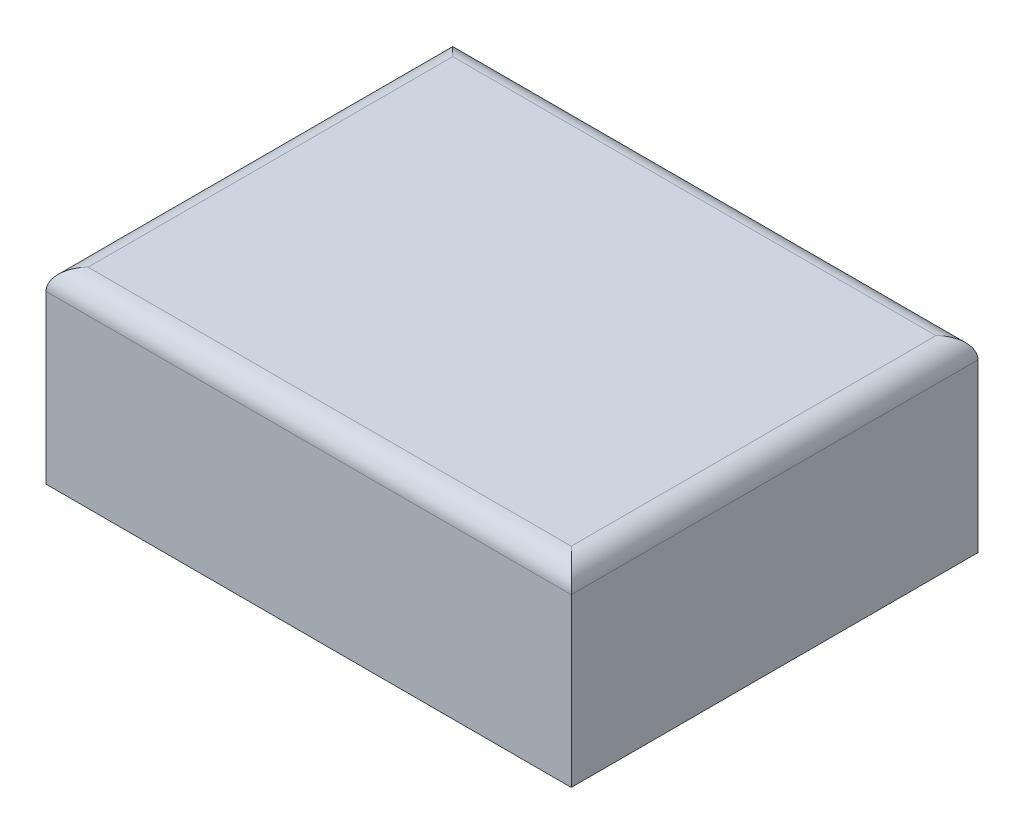
ISO-10303-21;
HEADER;
FILE_DESCRIPTION(('STEP AP214'),'2;1');
FILE_NAME('part.step','',(''),(''),'','','');
FILE_SCHEMA(('AUTOMOTIVE_DESIGN { 1 0 10303 214 1 1 1 1 }'));
ENDSEC;
DATA;
#1=APPLICATION_CONTEXT('core data for automotive mechanical design processes');
#2=APPLICATION_PROTOCOL_DEFINITION('international standard','automotive_design',2000,#1);
#3=PRODUCT_CONTEXT('',#1,'mechanical');
#4=PRODUCT('Part','Part','',(#3));
#5=PRODUCT_RELATED_PRODUCT_CATEGORY('part','',(#4));
#6=PRODUCT_DEFINITION_FORMATION('','',#4);
#7=PRODUCT_DEFINITION_CONTEXT('part definition',#1,'design');
#8=PRODUCT_DEFINITION('design','',#6,#7);
#9=PRODUCT_DEFINITION_SHAPE('','',#8);
#10=(LENGTH_UNIT() NAMED_UNIT(*) SI_UNIT(.MILLI.,.METRE.));
#11=(NAMED_UNIT(*) PLANE_ANGLE_UNIT() SI_UNIT($,.RADIAN.));
#12=(NAMED_UNIT(*) SI_UNIT($,.STERADIAN.) SOLID_ANGLE_UNIT());
#13=UNCERTAINTY_MEASURE_WITH_UNIT(LENGTH_MEASURE(1.E-05),#10,'distance_accuracy_value','');
#14=(GEOMETRIC_REPRESENTATION_CONTEXT(3) GLOBAL_UNCERTAINTY_ASSIGNED_CONTEXT((#13)) GLOBAL_UNIT_ASSIGNED_CONTEXT((#10,
#11,#12)) REPRESENTATION_CONTEXT('',''));
#15=CARTESIAN_POINT('',(0.,0.,0.));
#16=DIRECTION('',(0.,0.,1.));
#17=DIRECTION('',(1.,0.,0.));
#18=AXIS2_PLACEMENT_3D('',#15,#16,#17);
#19=CARTESIAN_POINT('',(-515.404534045085,-44.7241539831111,96.7914562518786));
#20=DIRECTION('',(0.,0.,-1.));
#21=DIRECTION('',(-1.,0.,0.));
#22=AXIS2_PLACEMENT_3D('',#19,#20,#21);
#23=PLANE('',#22);
#24=DIRECTION('',(0.,1.,0.));
#25=VECTOR('',#24,1.);
#26=CARTESIAN_POINT('',(-265.404534045085,-44.7241539831111,96.7914562518786));
#27=LINE('',#26,#25);
#28=CARTESIAN_POINT('',(-265.404534045085,-44.7241539831111,96.7914562518786));
#29=VERTEX_POINT('',#28);
#30=CARTESIAN_POINT('',(-265.404534045085,34.7241539831111,96.7914562518786));
#31=VERTEX_POINT('',#30);
#32=EDGE_CURVE('E117',#29,#31,#27,.T.);
#33=ORIENTED_EDGE('',*,*,#32,.T.);
#34=DIRECTION('',(1.,0.,0.));
#35=VECTOR('',#34,1.);
#36=CARTESIAN_POINT('',(-515.404534045085,34.7241539831111,96.7914562518786));
#37=LINE('',#36,#35);
#38=CARTESIAN_POINT('',(-515.404534045085,34.7241539831111,96.7914562518786));
#39=VERTEX_POINT('',#38);
#40=EDGE_CURVE('E131',#31,#39,#37,.F.);
#41=ORIENTED_EDGE('',*,*,#40,.T.);
#42=DIRECTION('',(0.,1.,0.));
#43=VECTOR('',#42,1.);
#44=CARTESIAN_POINT('',(-515.404534045085,-44.7241539831111,96.7914562518786));
#45=LINE('',#44,#43);
#46=CARTESIAN_POINT('',(-515.404534045085,-44.7241539831111,96.7914562518786));
#47=VERTEX_POINT('',#46);
#48=EDGE_CURVE('E99',#47,#39,#45,.T.);
#49=ORIENTED_EDGE('',*,*,#48,.F.);
#50=DIRECTION('',(1.,0.,0.));
#51=VECTOR('',#50,1.);
#52=CARTESIAN_POINT('',(-515.404534045085,-44.7241539831111,96.7914562518786));
#53=LINE('',#52,#51);
#54=EDGE_CURVE('E108',#47,#29,#53,.T.);
#55=ORIENTED_EDGE('',*,*,#54,.T.);
#56=EDGE_LOOP('',(#33,#41,#49,#55));
#57=FACE_BOUND('',#56,.T.);
#58=ADVANCED_FACE('F42',(#57),#23,.F.);
#59=CARTESIAN_POINT('',(-515.404534045085,44.7241539831111,-96.7914562518786));
#60=DIRECTION('',(0.,-1.,0.));
#61=DIRECTION('',(1.,0.,0.));
#62=AXIS2_PLACEMENT_3D('',#59,#60,#61);
#63=PLANE('',#62);
#64=DIRECTION('',(0.,0.,-1.));
#65=VECTOR('',#64,1.);
#66=CARTESIAN_POINT('',(-505.404534045085,44.7241539831111,-96.7914562518786));
#67=LINE('',#66,#65);
#68=CARTESIAN_POINT('',(-505.404534045085,44.7241539831111,-86.7914562518786));
#69=VERTEX_POINT('',#68);
#70=CARTESIAN_POINT('',(-505.404534045085,44.7241539831111,86.7914562518786));
#71=VERTEX_POINT('',#70);
#72=EDGE_CURVE('E126',#69,#71,#67,.F.);
#73=ORIENTED_EDGE('',*,*,#72,.T.);
#74=DIRECTION('',(1.,0.,0.));
#75=VECTOR('',#74,1.);
#76=CARTESIAN_POINT('',(-515.404534045085,44.7241539831111,86.7914562518786));
#77=LINE('',#76,#75);
#78=CARTESIAN_POINT('',(-275.404534045085,44.7241539831111,86.7914562518786));
#79=VERTEX_POINT('',#78);
#80=EDGE_CURVE('E128',#71,#79,#77,.T.);
#81=ORIENTED_EDGE('',*,*,#80,.T.);
#82=DIRECTION('',(0.,0.,-1.));
#83=VECTOR('',#82,1.);
#84=CARTESIAN_POINT('',(-275.404534045085,44.7241539831111,-96.7914562518786));
#85=LINE('',#84,#83);
#86=CARTESIAN_POINT('',(-275.404534045085,44.7241539831111,-86.7914562518786));
#87=VERTEX_POINT('',#86);
#88=EDGE_CURVE('E107',#79,#87,#85,.T.);
#89=ORIENTED_EDGE('',*,*,#88,.T.);
#90=DIRECTION('',(1.,0.,0.));
#91=VECTOR('',#90,1.);
#92=CARTESIAN_POINT('',(-515.404534045085,44.7241539831111,-86.7914562518786));
#93=LINE('',#92,#91);
#94=EDGE_CURVE('E124',#87,#69,#93,.F.);
#95=ORIENTED_EDGE('',*,*,#94,.T.);
#96=EDGE_LOOP('',(#73,#81,#89,#95));
#97=FACE_BOUND('',#96,.T.);
#98=ADVANCED_FACE('F164',(#97),#63,.F.);
#99=CARTESIAN_POINT('',(-515.404534045085,-44.7241539831111,-96.7914562518786));
#100=DIRECTION('',(0.,0.,1.));
#101=DIRECTION('',(1.,0.,0.));
#102=AXIS2_PLACEMENT_3D('',#99,#100,#101);
#103=PLANE('',#102);
#104=DIRECTION('',(0.,-1.,0.));
#105=VECTOR('',#104,1.);
#106=CARTESIAN_POINT('',(-515.404534045085,-44.7241539831111,-96.7914562518786));
#107=LINE('',#106,#105);
#108=CARTESIAN_POINT('',(-515.404534045085,34.7241539831111,-96.7914562518786));
#109=VERTEX_POINT('',#108);
#110=CARTESIAN_POINT('',(-515.404534045085,-44.7241539831111,-96.7914562518786));
#111=VERTEX_POINT('',#110);
#112=EDGE_CURVE('E93',#109,#111,#107,.T.);
#113=ORIENTED_EDGE('',*,*,#112,.F.);
#114=DIRECTION('',(1.,0.,0.));
#115=VECTOR('',#114,1.);
#116=CARTESIAN_POINT('',(-515.404534045085,34.7241539831111,-96.7914562518786));
#117=LINE('',#116,#115);
#118=CARTESIAN_POINT('',(-265.404534045085,34.7241539831111,-96.7914562518786));
#119=VERTEX_POINT('',#118);
#120=EDGE_CURVE('E51',#109,#119,#117,.T.);
#121=ORIENTED_EDGE('',*,*,#120,.T.);
#122=DIRECTION('',(0.,-1.,0.));
#123=VECTOR('',#122,1.);
#124=CARTESIAN_POINT('',(-265.404534045085,-44.7241539831111,-96.7914562518786));
#125=LINE('',#124,#123);
#126=CARTESIAN_POINT('',(-265.404534045085,-44.7241539831111,-96.7914562518786));
#127=VERTEX_POINT('',#126);
#128=EDGE_CURVE('E104',#119,#127,#125,.T.);
#129=ORIENTED_EDGE('',*,*,#128,.T.);
#130=DIRECTION('',(1.,0.,0.));
#131=VECTOR('',#130,1.);
#132=CARTESIAN_POINT('',(-515.404534045085,-44.7241539831111,-96.7914562518786));
#133=LINE('',#132,#131);
#134=EDGE_CURVE('E102',#111,#127,#133,.T.);
#135=ORIENTED_EDGE('',*,*,#134,.F.);
#136=EDGE_LOOP('',(#113,#121,#129,#135));
#137=FACE_BOUND('',#136,.T.);
#138=ADVANCED_FACE('F103',(#137),#103,.F.);
#139=CARTESIAN_POINT('',(-515.404534045085,-44.7241539831111,-96.7914562518786));
#140=DIRECTION('',(0.,1.,0.));
#141=DIRECTION('',(-1.,0.,0.));
#142=AXIS2_PLACEMENT_3D('',#139,#140,#141);
#143=PLANE('',#142);
#144=DIRECTION('',(0.,0.,1.));
#145=VECTOR('',#144,1.);
#146=CARTESIAN_POINT('',(-265.404534045085,-44.7241539831111,-96.7914562518786));
#147=LINE('',#146,#145);
#148=EDGE_CURVE('E121',#127,#29,#147,.T.);
#149=ORIENTED_EDGE('',*,*,#148,.T.);
#150=ORIENTED_EDGE('',*,*,#54,.F.);
#151=DIRECTION('',(0.,0.,1.));
#152=VECTOR('',#151,1.);
#153=CARTESIAN_POINT('',(-515.404534045085,-44.7241539831111,-96.7914562518786));
#154=LINE('',#153,#152);
#155=EDGE_CURVE('E97',#111,#47,#154,.T.);
#156=ORIENTED_EDGE('',*,*,#155,.F.);
#157=ORIENTED_EDGE('',*,*,#134,.T.);
#158=EDGE_LOOP('',(#149,#150,#156,#157));
#159=FACE_BOUND('',#158,.T.);
#160=ADVANCED_FACE('F110',(#159),#143,.F.);
#161=CARTESIAN_POINT('',(-515.404534045085,0.,0.));
#162=DIRECTION('',(1.,0.,0.));
#163=DIRECTION('',(0.,0.,-1.));
#164=AXIS2_PLACEMENT_3D('',#161,#162,#163);
#165=PLANE('',#164);
#166=ORIENTED_EDGE('',*,*,#48,.T.);
#167=DIRECTION('',(0.,0.,-1.));
#168=VECTOR('',#167,1.);
#169=CARTESIAN_POINT('',(-515.404534045085,34.7241539831111,0.));
#170=LINE('',#169,#168);
#171=EDGE_CURVE('E66',#39,#109,#170,.T.);
#172=ORIENTED_EDGE('',*,*,#171,.T.);
#173=ORIENTED_EDGE('',*,*,#112,.T.);
#174=ORIENTED_EDGE('',*,*,#155,.T.);
#175=EDGE_LOOP('',(#166,#172,#173,#174));
#176=FACE_BOUND('',#175,.T.);
#177=ADVANCED_FACE('F95',(#176),#165,.F.);
#178=CARTESIAN_POINT('',(-265.404534045085,0.,0.));
#179=DIRECTION('',(1.,0.,0.));
#180=DIRECTION('',(0.,0.,-1.));
#181=AXIS2_PLACEMENT_3D('',#178,#179,#180);
#182=PLANE('',#181);
#183=ORIENTED_EDGE('',*,*,#128,.F.);
#184=DIRECTION('',(0.,0.,-1.));
#185=VECTOR('',#184,1.);
#186=CARTESIAN_POINT('',(-265.404534045085,34.7241539831111,96.7914562518786));
#187=LINE('',#186,#185);
#188=EDGE_CURVE('E12',#119,#31,#187,.F.);
#189=ORIENTED_EDGE('',*,*,#188,.T.);
#190=ORIENTED_EDGE('',*,*,#32,.F.);
#191=ORIENTED_EDGE('',*,*,#148,.F.);
#192=EDGE_LOOP('',(#183,#189,#190,#191));
#193=FACE_BOUND('',#192,.T.);
#194=ADVANCED_FACE('F157',(#193),#182,.T.);
#195=CARTESIAN_POINT('',(-515.404534045085,34.7241539831111,-86.7914562518786));
#196=DIRECTION('',(1.,0.,0.));
#197=DIRECTION('',(0.,1.,0.));
#198=AXIS2_PLACEMENT_3D('',#195,#196,#197);
#199=CYLINDRICAL_SURFACE('',#198,10.);
#200=CARTESIAN_POINT('',(-275.404534045085,34.7241539831111,-86.7914562518786));
#201=DIRECTION('',(0.707106781186547,0.,0.707106781186547));
#202=DIRECTION('',(-0.707106781186547,0.,0.707106781186547));
#203=AXIS2_PLACEMENT_3D('',#200,#201,#202);
#204=ELLIPSE('',#203,14.1421356237309,10.);
#205=EDGE_CURVE('E139',#119,#87,#204,.T.);
#206=ORIENTED_EDGE('',*,*,#205,.F.);
#207=ORIENTED_EDGE('',*,*,#120,.F.);
#208=CARTESIAN_POINT('',(-505.404534045085,34.7241539831111,-86.7914562518786));
#209=DIRECTION('',(0.707106781186547,0.,-0.707106781186547));
#210=DIRECTION('',(0.707106781186547,0.,0.707106781186547));
#211=AXIS2_PLACEMENT_3D('',#208,#209,#210);
#212=ELLIPSE('',#211,14.1421356237309,10.);
#213=EDGE_CURVE('E46',#69,#109,#212,.F.);
#214=ORIENTED_EDGE('',*,*,#213,.F.);
#215=ORIENTED_EDGE('',*,*,#94,.F.);
#216=EDGE_LOOP('',(#206,#207,#214,#215));
#217=FACE_BOUND('',#216,.T.);
#218=ADVANCED_FACE('F44',(#217),#199,.T.);
#219=CARTESIAN_POINT('',(-505.404534045085,34.7241539831111,0.));
#220=DIRECTION('',(0.,0.,-1.));
#221=DIRECTION('',(-1.,0.,0.));
#222=AXIS2_PLACEMENT_3D('',#219,#220,#221);
#223=CYLINDRICAL_SURFACE('',#222,10.);
#224=ORIENTED_EDGE('',*,*,#213,.T.);
#225=ORIENTED_EDGE('',*,*,#171,.F.);
#226=CARTESIAN_POINT('',(-505.404534045085,34.7241539831111,86.7914562518786));
#227=DIRECTION('',(-0.707106781186547,0.,-0.707106781186547));
#228=DIRECTION('',(0.707106781186547,0.,-0.707106781186547));
#229=AXIS2_PLACEMENT_3D('',#226,#227,#228);
#230=ELLIPSE('',#229,14.1421356237309,10.);
#231=EDGE_CURVE('E138',#71,#39,#230,.F.);
#232=ORIENTED_EDGE('',*,*,#231,.F.);
#233=ORIENTED_EDGE('',*,*,#72,.F.);
#234=EDGE_LOOP('',(#224,#225,#232,#233));
#235=FACE_BOUND('',#234,.T.);
#236=ADVANCED_FACE('F149',(#235),#223,.T.);
#237=CARTESIAN_POINT('',(-275.404534045085,34.7241539831111,-96.7914562518786));
#238=DIRECTION('',(0.,0.,1.));
#239=DIRECTION('',(1.,0.,0.));
#240=AXIS2_PLACEMENT_3D('',#237,#238,#239);
#241=CYLINDRICAL_SURFACE('',#240,10.);
#242=ORIENTED_EDGE('',*,*,#205,.T.);
#243=ORIENTED_EDGE('',*,*,#88,.F.);
#244=CARTESIAN_POINT('',(-275.404534045085,34.7241539831111,86.7914562518786));
#245=DIRECTION('',(-0.707106781186547,0.,0.707106781186547));
#246=DIRECTION('',(0.707106781186547,0.,0.707106781186547));
#247=AXIS2_PLACEMENT_3D('',#244,#245,#246);
#248=ELLIPSE('',#247,14.1421356237309,10.);
#249=EDGE_CURVE('E136',#31,#79,#248,.T.);
#250=ORIENTED_EDGE('',*,*,#249,.F.);
#251=ORIENTED_EDGE('',*,*,#188,.F.);
#252=EDGE_LOOP('',(#242,#243,#250,#251));
#253=FACE_BOUND('',#252,.T.);
#254=ADVANCED_FACE('F154',(#253),#241,.T.);
#255=CARTESIAN_POINT('',(-515.404534045085,34.7241539831111,86.7914562518786));
#256=DIRECTION('',(1.,0.,0.));
#257=DIRECTION('',(0.,1.,0.));
#258=AXIS2_PLACEMENT_3D('',#255,#256,#257);
#259=CYLINDRICAL_SURFACE('',#258,10.);
#260=ORIENTED_EDGE('',*,*,#231,.T.);
#261=ORIENTED_EDGE('',*,*,#40,.F.);
#262=ORIENTED_EDGE('',*,*,#249,.T.);
#263=ORIENTED_EDGE('',*,*,#80,.F.);
#264=EDGE_LOOP('',(#260,#261,#262,#263));
#265=FACE_BOUND('',#264,.T.);
#266=ADVANCED_FACE('F161',(#265),#259,.T.);
#267=CLOSED_SHELL('',(#58,#98,#138,#160,#177,#194,#218,#236,#254,#266));
#268=MANIFOLD_SOLID_BREP('B2',#267);
#269=ADVANCED_BREP_SHAPE_REPRESENTATION('',(#18,#268),#14);
#270=SHAPE_DEFINITION_REPRESENTATION(#9,#269);
ENDSEC;
END-ISO-10303-21;
